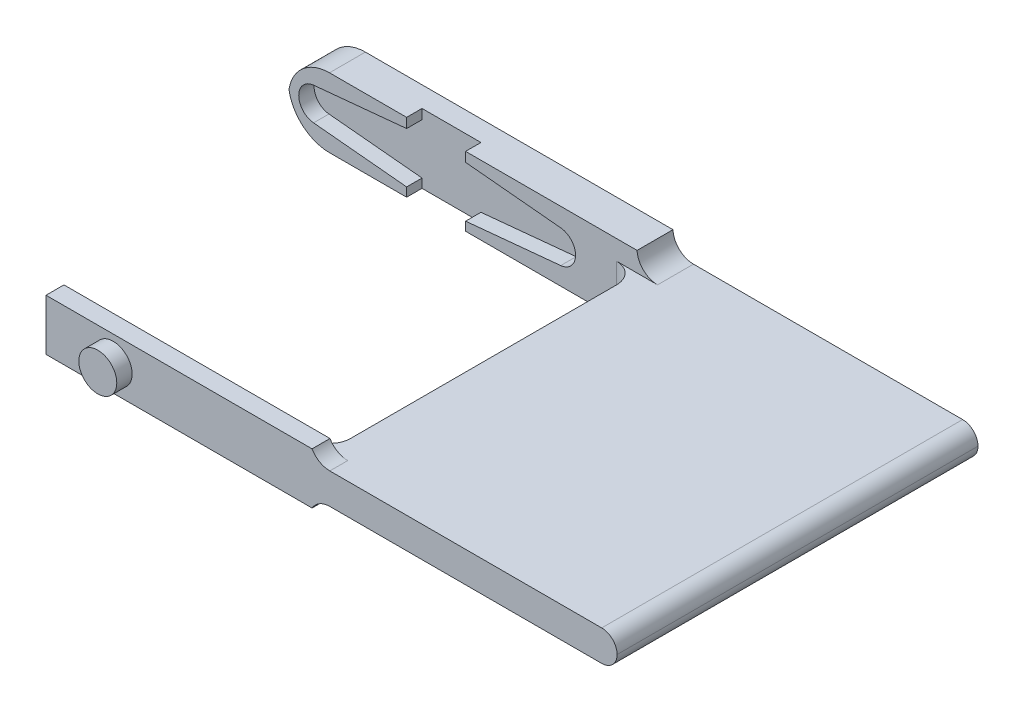
ISO-10303-21;
HEADER;
FILE_DESCRIPTION(('STEP AP214'),'2;1');
FILE_NAME('part.step','',(''),(''),'','','');
FILE_SCHEMA(('AUTOMOTIVE_DESIGN { 1 0 10303 214 1 1 1 1 }'));
ENDSEC;
DATA;
#1=APPLICATION_CONTEXT('core data for automotive mechanical design processes');
#2=APPLICATION_PROTOCOL_DEFINITION('international standard','automotive_design',2000,#1);
#3=PRODUCT_CONTEXT('',#1,'mechanical');
#4=PRODUCT('Part','Part','',(#3));
#5=PRODUCT_RELATED_PRODUCT_CATEGORY('part','',(#4));
#6=PRODUCT_DEFINITION_FORMATION('','',#4);
#7=PRODUCT_DEFINITION_CONTEXT('part definition',#1,'design');
#8=PRODUCT_DEFINITION('design','',#6,#7);
#9=PRODUCT_DEFINITION_SHAPE('','',#8);
#10=(LENGTH_UNIT() NAMED_UNIT(*) SI_UNIT(.MILLI.,.METRE.));
#11=(NAMED_UNIT(*) PLANE_ANGLE_UNIT() SI_UNIT($,.RADIAN.));
#12=(NAMED_UNIT(*) SI_UNIT($,.STERADIAN.) SOLID_ANGLE_UNIT());
#13=UNCERTAINTY_MEASURE_WITH_UNIT(LENGTH_MEASURE(1.E-05),#10,'distance_accuracy_value','');
#14=(GEOMETRIC_REPRESENTATION_CONTEXT(3) GLOBAL_UNCERTAINTY_ASSIGNED_CONTEXT((#13)) GLOBAL_UNIT_ASSIGNED_CONTEXT((#10,
#11,#12)) REPRESENTATION_CONTEXT('',''));
#15=CARTESIAN_POINT('',(0.,0.,0.));
#16=DIRECTION('',(0.,0.,1.));
#17=DIRECTION('',(1.,0.,0.));
#18=AXIS2_PLACEMENT_3D('',#15,#16,#17);
#19=CARTESIAN_POINT('',(0.,0.,35.2));
#20=DIRECTION('',(0.,0.,1.));
#21=DIRECTION('',(1.,0.,0.));
#22=AXIS2_PLACEMENT_3D('',#19,#20,#21);
#23=PLANE('',#22);
#24=CARTESIAN_POINT('',(47.75,3.33707186120483,35.2));
#25=DIRECTION('',(0.,0.,1.));
#26=DIRECTION('',(1.,0.,0.));
#27=AXIS2_PLACEMENT_3D('',#24,#25,#26);
#28=CIRCLE('',#27,1.5);
#29=CARTESIAN_POINT('',(47.75,1.83707186120483,35.2));
#30=VERTEX_POINT('',#29);
#31=CARTESIAN_POINT('',(49.25,3.33707186120483,35.2));
#32=VERTEX_POINT('',#31);
#33=EDGE_CURVE('E156',#30,#32,#28,.T.);
#34=ORIENTED_EDGE('',*,*,#33,.T.);
#35=CARTESIAN_POINT('',(47.75,3.33707186120483,35.2));
#36=DIRECTION('',(0.,0.,1.));
#37=DIRECTION('',(1.,0.,0.));
#38=AXIS2_PLACEMENT_3D('',#35,#36,#37);
#39=CIRCLE('',#38,1.5);
#40=CARTESIAN_POINT('',(47.75,4.83707186120483,35.2));
#41=VERTEX_POINT('',#40);
#42=EDGE_CURVE('E149',#32,#41,#39,.T.);
#43=ORIENTED_EDGE('',*,*,#42,.T.);
#44=DIRECTION('',(1.,0.,0.));
#45=VECTOR('',#44,1.);
#46=CARTESIAN_POINT('',(0.,4.83707186120483,35.2));
#47=LINE('',#46,#45);
#48=CARTESIAN_POINT('',(21.2320508075689,4.83707186120483,35.2));
#49=VERTEX_POINT('',#48);
#50=EDGE_CURVE('E506',#49,#41,#47,.T.);
#51=ORIENTED_EDGE('',*,*,#50,.F.);
#52=CARTESIAN_POINT('',(21.2320508075689,6.83707186120483,35.2));
#53=DIRECTION('',(0.,0.,1.));
#54=DIRECTION('',(1.,0.,0.));
#55=AXIS2_PLACEMENT_3D('',#52,#53,#54);
#56=CIRCLE('',#55,2.);
#57=CARTESIAN_POINT('',(19.5,5.83707186120483,35.2));
#58=VERTEX_POINT('',#57);
#59=EDGE_CURVE('E445',#49,#58,#56,.F.);
#60=ORIENTED_EDGE('',*,*,#59,.T.);
#61=DIRECTION('',(1.,0.,0.));
#62=VECTOR('',#61,1.);
#63=CARTESIAN_POINT('',(0.,5.83707186120483,35.2));
#64=LINE('',#63,#62);
#65=CARTESIAN_POINT('',(-6.45,5.83707186120483,35.2));
#66=VERTEX_POINT('',#65);
#67=EDGE_CURVE('E569',#66,#58,#64,.T.);
#68=ORIENTED_EDGE('',*,*,#67,.F.);
#69=DIRECTION('',(0.,-1.,0.));
#70=VECTOR('',#69,1.);
#71=CARTESIAN_POINT('',(-6.45,0.,35.2));
#72=LINE('',#71,#70);
#73=CARTESIAN_POINT('',(-6.45,0.837071861204826,35.2));
#74=VERTEX_POINT('',#73);
#75=EDGE_CURVE('E493',#66,#74,#72,.T.);
#76=ORIENTED_EDGE('',*,*,#75,.T.);
#77=DIRECTION('',(1.,0.,0.));
#78=VECTOR('',#77,1.);
#79=CARTESIAN_POINT('',(0.,0.837071861204826,35.2));
#80=LINE('',#79,#78);
#81=CARTESIAN_POINT('',(19.5,0.837071861204826,35.2));
#82=VERTEX_POINT('',#81);
#83=EDGE_CURVE('E578',#74,#82,#80,.T.);
#84=ORIENTED_EDGE('',*,*,#83,.T.);
#85=CARTESIAN_POINT('',(21.2320508075689,-0.16292813879517,35.2));
#86=DIRECTION('',(0.,0.,1.));
#87=DIRECTION('',(1.,0.,0.));
#88=AXIS2_PLACEMENT_3D('',#85,#86,#87);
#89=CIRCLE('',#88,2.);
#90=CARTESIAN_POINT('',(21.2320508075689,1.83707186120483,35.2));
#91=VERTEX_POINT('',#90);
#92=EDGE_CURVE('E441',#82,#91,#89,.F.);
#93=ORIENTED_EDGE('',*,*,#92,.T.);
#94=DIRECTION('',(1.,0.,0.));
#95=VECTOR('',#94,1.);
#96=CARTESIAN_POINT('',(0.,1.83707186120483,35.2));
#97=LINE('',#96,#95);
#98=EDGE_CURVE('E585',#91,#30,#97,.T.);
#99=ORIENTED_EDGE('',*,*,#98,.T.);
#100=EDGE_LOOP('',(#34,#43,#51,#60,#68,#76,#84,#93,#99));
#101=FACE_BOUND('',#100,.T.);
#102=CARTESIAN_POINT('',(0.102107464173086,3.37500000000001,35.2));
#103=DIRECTION('',(0.,0.,1.));
#104=DIRECTION('',(1.,0.,0.));
#105=AXIS2_PLACEMENT_3D('',#102,#103,#104);
#106=CIRCLE('',#105,1.85);
#107=CARTESIAN_POINT('',(1.95210746417309,3.37500000000001,35.2));
#108=VERTEX_POINT('',#107);
#109=EDGE_CURVE('E525',#108,#108,#106,.T.);
#110=ORIENTED_EDGE('',*,*,#109,.F.);
#111=EDGE_LOOP('',(#110));
#112=FACE_BOUND('',#111,.T.);
#113=ADVANCED_FACE('F140',(#101,#112),#23,.T.);
#114=CARTESIAN_POINT('',(0.,0.,3.5));
#115=DIRECTION('',(0.,0.,1.));
#116=DIRECTION('',(1.,0.,0.));
#117=AXIS2_PLACEMENT_3D('',#114,#115,#116);
#118=PLANE('',#117);
#119=DIRECTION('',(0.,1.,0.));
#120=VECTOR('',#119,1.);
#121=CARTESIAN_POINT('',(2.77289253582673,0.,3.5));
#122=LINE('',#121,#120);
#123=CARTESIAN_POINT('',(2.77289253582673,0.,3.5));
#124=VERTEX_POINT('',#123);
#125=CARTESIAN_POINT('',(2.77289253582673,0.853325704371567,3.5));
#126=VERTEX_POINT('',#125);
#127=EDGE_CURVE('E361',#124,#126,#122,.T.);
#128=ORIENTED_EDGE('',*,*,#127,.F.);
#129=DIRECTION('',(1.,0.,0.));
#130=VECTOR('',#129,1.);
#131=CARTESIAN_POINT('',(0.,0.,3.5));
#132=LINE('',#131,#130);
#133=CARTESIAN_POINT('',(19.5,0.,3.5));
#134=VERTEX_POINT('',#133);
#135=EDGE_CURVE('E378',#124,#134,#132,.T.);
#136=ORIENTED_EDGE('',*,*,#135,.T.);
#137=CARTESIAN_POINT('',(21.4933525582768,-0.16292813879517,3.5));
#138=DIRECTION('',(0.,0.,1.));
#139=DIRECTION('',(1.,0.,0.));
#140=AXIS2_PLACEMENT_3D('',#137,#138,#139);
#141=CIRCLE('',#140,2.);
#142=CARTESIAN_POINT('',(21.4933525582768,1.83707186120483,3.5));
#143=VERTEX_POINT('',#142);
#144=EDGE_CURVE('E455',#134,#143,#141,.F.);
#145=ORIENTED_EDGE('',*,*,#144,.T.);
#146=DIRECTION('',(1.,0.,0.));
#147=VECTOR('',#146,1.);
#148=CARTESIAN_POINT('',(0.,1.83707186120483,3.5));
#149=LINE('',#148,#147);
#150=CARTESIAN_POINT('',(17.5,1.83707186120483,3.5));
#151=VERTEX_POINT('',#150);
#152=EDGE_CURVE('E418',#151,#143,#149,.T.);
#153=ORIENTED_EDGE('',*,*,#152,.F.);
#154=DIRECTION('',(0.,1.,0.));
#155=VECTOR('',#154,1.);
#156=CARTESIAN_POINT('',(17.5,4.83707186120483,3.5));
#157=LINE('',#156,#155);
#158=CARTESIAN_POINT('',(17.5,4.83707186120483,3.5));
#159=VERTEX_POINT('',#158);
#160=EDGE_CURVE('E457',#151,#159,#157,.T.);
#161=ORIENTED_EDGE('',*,*,#160,.T.);
#162=DIRECTION('',(-1.,0.,0.));
#163=VECTOR('',#162,1.);
#164=CARTESIAN_POINT('',(0.,4.83707186120483,3.5));
#165=LINE('',#164,#163);
#166=CARTESIAN_POINT('',(21.4981037237807,4.83707186120483,3.5));
#167=VERTEX_POINT('',#166);
#168=EDGE_CURVE('E429',#167,#159,#165,.T.);
#169=ORIENTED_EDGE('',*,*,#168,.F.);
#170=CARTESIAN_POINT('',(21.4981037237807,6.83707186120483,3.5));
#171=DIRECTION('',(0.,0.,1.));
#172=DIRECTION('',(1.,0.,0.));
#173=AXIS2_PLACEMENT_3D('',#170,#171,#172);
#174=CIRCLE('',#173,2.);
#175=CARTESIAN_POINT('',(19.5,6.75,3.5));
#176=VERTEX_POINT('',#175);
#177=EDGE_CURVE('E449',#167,#176,#174,.F.);
#178=ORIENTED_EDGE('',*,*,#177,.T.);
#179=DIRECTION('',(1.,0.,0.));
#180=VECTOR('',#179,1.);
#181=CARTESIAN_POINT('',(0.,6.75,3.5));
#182=LINE('',#181,#180);
#183=CARTESIAN_POINT('',(2.77289253582673,6.7500000000001,3.5));
#184=VERTEX_POINT('',#183);
#185=EDGE_CURVE('E406',#184,#176,#182,.T.);
#186=ORIENTED_EDGE('',*,*,#185,.F.);
#187=DIRECTION('',(0.,1.,0.));
#188=VECTOR('',#187,1.);
#189=CARTESIAN_POINT('',(2.77289253582673,6.7500000000001,3.5));
#190=LINE('',#189,#188);
#191=CARTESIAN_POINT('',(2.77289253582673,5.82081801803809,3.5));
#192=VERTEX_POINT('',#191);
#193=EDGE_CURVE('E554',#192,#184,#190,.T.);
#194=ORIENTED_EDGE('',*,*,#193,.F.);
#195=DIRECTION('',(-0.995421689915833,0.0955806426276088,0.));
#196=VECTOR('',#195,1.);
#197=CARTESIAN_POINT('',(0.579142550837787,6.03146244688038,3.5));
#198=LINE('',#197,#196);
#199=CARTESIAN_POINT('',(12.0529290282042,4.92974656507016,3.5));
#200=VERTEX_POINT('',#199);
#201=EDGE_CURVE('E377',#200,#192,#198,.T.);
#202=ORIENTED_EDGE('',*,*,#201,.F.);
#203=CARTESIAN_POINT('',(11.9,3.33707186120483,3.5));
#204=DIRECTION('',(0.,0.,1.));
#205=DIRECTION('',(1.,0.,0.));
#206=AXIS2_PLACEMENT_3D('',#203,#204,#205);
#207=CIRCLE('',#206,1.59999999999999);
#208=CARTESIAN_POINT('',(12.0529290282042,1.7443971573395,3.5));
#209=VERTEX_POINT('',#208);
#210=EDGE_CURVE('E381',#200,#209,#207,.F.);
#211=ORIENTED_EDGE('',*,*,#210,.T.);
#212=DIRECTION('',(-0.995421689915833,-0.0955806426276091,0.));
#213=VECTOR('',#212,1.);
#214=CARTESIAN_POINT('',(-0.0558558043959016,0.581708572728471,3.5));
#215=LINE('',#214,#213);
#216=EDGE_CURVE('E389',#209,#126,#215,.T.);
#217=ORIENTED_EDGE('',*,*,#216,.T.);
#218=EDGE_LOOP('',(#128,#136,#145,#153,#161,#169,#178,#186,#194,#202,#211,#217));
#219=FACE_BOUND('',#218,.T.);
#220=ADVANCED_FACE('F652',(#219),#118,.T.);
#221=CARTESIAN_POINT('',(19.5,0.,65.1008779135329));
#222=DIRECTION('',(-1.,0.,0.));
#223=DIRECTION('',(0.,0.,1.));
#224=AXIS2_PLACEMENT_3D('',#221,#222,#223);
#225=PLANE('',#224);
#226=DIRECTION('',(0.,0.,-1.));
#227=VECTOR('',#226,1.);
#228=CARTESIAN_POINT('',(19.5,4.83707186120483,65.1008779135329));
#229=LINE('',#228,#227);
#230=CARTESIAN_POINT('',(19.5,4.83707186120483,31.45));
#231=VERTEX_POINT('',#230);
#232=CARTESIAN_POINT('',(19.5,4.83707186120483,5.5));
#233=VERTEX_POINT('',#232);
#234=EDGE_CURVE('E594',#231,#233,#229,.T.);
#235=ORIENTED_EDGE('',*,*,#234,.T.);
#236=DIRECTION('',(0.,1.,0.));
#237=VECTOR('',#236,1.);
#238=CARTESIAN_POINT('',(19.5,1.83707186120483,5.5));
#239=LINE('',#238,#237);
#240=CARTESIAN_POINT('',(19.5,1.83707186120483,5.5));
#241=VERTEX_POINT('',#240);
#242=EDGE_CURVE('E462',#233,#241,#239,.F.);
#243=ORIENTED_EDGE('',*,*,#242,.T.);
#244=DIRECTION('',(0.,0.,-1.));
#245=VECTOR('',#244,1.);
#246=CARTESIAN_POINT('',(19.5,1.83707186120483,65.1008779135329));
#247=LINE('',#246,#245);
#248=CARTESIAN_POINT('',(19.5,1.83707186120483,31.45));
#249=VERTEX_POINT('',#248);
#250=EDGE_CURVE('E516',#249,#241,#247,.T.);
#251=ORIENTED_EDGE('',*,*,#250,.F.);
#252=DIRECTION('',(0.,-1.,0.));
#253=VECTOR('',#252,1.);
#254=CARTESIAN_POINT('',(19.5,0.,31.45));
#255=LINE('',#254,#253);
#256=EDGE_CURVE('E460',#249,#231,#255,.F.);
#257=ORIENTED_EDGE('',*,*,#256,.T.);
#258=EDGE_LOOP('',(#235,#243,#251,#257));
#259=FACE_BOUND('',#258,.T.);
#260=ADVANCED_FACE('F671',(#259),#225,.T.);
#261=CARTESIAN_POINT('',(0.579142550837787,6.03146244688038,3.5));
#262=DIRECTION('',(-0.0955806426276088,-0.995421689915833,0.));
#263=DIRECTION('',(0.995421689915833,-0.0955806426276088,0.));
#264=AXIS2_PLACEMENT_3D('',#261,#262,#263);
#265=PLANE('',#264);
#266=DIRECTION('',(0.,0.,1.));
#267=VECTOR('',#266,1.);
#268=CARTESIAN_POINT('',(2.77289253582673,5.82081801803809,3.5));
#269=LINE('',#268,#267);
#270=CARTESIAN_POINT('',(2.77289253582673,5.82081801803809,2.));
#271=VERTEX_POINT('',#270);
#272=EDGE_CURVE('E494',#271,#192,#269,.T.);
#273=ORIENTED_EDGE('',*,*,#272,.F.);
#274=DIRECTION('',(-0.995421689915833,0.0955806426276088,0.));
#275=VECTOR('',#274,1.);
#276=CARTESIAN_POINT('',(0.579142550837787,6.03146244688038,2.));
#277=LINE('',#276,#275);
#278=CARTESIAN_POINT('',(12.0529290282042,4.92974656507016,2.));
#279=VERTEX_POINT('',#278);
#280=EDGE_CURVE('E605',#279,#271,#277,.T.);
#281=ORIENTED_EDGE('',*,*,#280,.F.);
#282=DIRECTION('',(0.,0.,-1.));
#283=VECTOR('',#282,1.);
#284=CARTESIAN_POINT('',(12.0529290282042,4.92974656507016,3.5));
#285=LINE('',#284,#283);
#286=EDGE_CURVE('E415',#200,#279,#285,.T.);
#287=ORIENTED_EDGE('',*,*,#286,.F.);
#288=ORIENTED_EDGE('',*,*,#201,.T.);
#289=EDGE_LOOP('',(#273,#281,#287,#288));
#290=FACE_BOUND('',#289,.T.);
#291=ADVANCED_FACE('F734',(#290),#265,.T.);
#292=CARTESIAN_POINT('',(11.9,3.33707186120483,3.5));
#293=DIRECTION('',(0.,0.,-1.));
#294=DIRECTION('',(-1.,0.,0.));
#295=AXIS2_PLACEMENT_3D('',#292,#293,#294);
#296=CYLINDRICAL_SURFACE('',#295,1.59999999999999);
#297=ORIENTED_EDGE('',*,*,#286,.T.);
#298=CARTESIAN_POINT('',(11.9,3.33707186120483,2.));
#299=DIRECTION('',(0.,0.,1.));
#300=DIRECTION('',(1.,0.,0.));
#301=AXIS2_PLACEMENT_3D('',#298,#299,#300);
#302=CIRCLE('',#301,1.59999999999999);
#303=CARTESIAN_POINT('',(12.0529290282042,1.7443971573395,2.));
#304=VERTEX_POINT('',#303);
#305=EDGE_CURVE('E404',#279,#304,#302,.F.);
#306=ORIENTED_EDGE('',*,*,#305,.T.);
#307=DIRECTION('',(0.,0.,-1.));
#308=VECTOR('',#307,1.);
#309=CARTESIAN_POINT('',(12.0529290282042,1.7443971573395,3.5));
#310=LINE('',#309,#308);
#311=EDGE_CURVE('E412',#209,#304,#310,.T.);
#312=ORIENTED_EDGE('',*,*,#311,.F.);
#313=ORIENTED_EDGE('',*,*,#210,.F.);
#314=EDGE_LOOP('',(#297,#306,#312,#313));
#315=FACE_BOUND('',#314,.T.);
#316=ADVANCED_FACE('F730',(#315),#296,.F.);
#317=CARTESIAN_POINT('',(-0.0558558043959016,0.581708572728471,3.5));
#318=DIRECTION('',(0.0955806426276091,-0.995421689915833,0.));
#319=DIRECTION('',(0.995421689915833,0.0955806426276091,0.));
#320=AXIS2_PLACEMENT_3D('',#317,#318,#319);
#321=PLANE('',#320);
#322=DIRECTION('',(-0.995421689915833,-0.0955806426276091,0.));
#323=VECTOR('',#322,1.);
#324=CARTESIAN_POINT('',(-0.0558558043959016,0.581708572728471,2.));
#325=LINE('',#324,#323);
#326=CARTESIAN_POINT('',(2.77289253582673,0.853325704371567,2.));
#327=VERTEX_POINT('',#326);
#328=EDGE_CURVE('E608',#304,#327,#325,.T.);
#329=ORIENTED_EDGE('',*,*,#328,.T.);
#330=DIRECTION('',(0.,0.,1.));
#331=VECTOR('',#330,1.);
#332=CARTESIAN_POINT('',(2.77289253582673,0.853325704371567,3.5));
#333=LINE('',#332,#331);
#334=EDGE_CURVE('E542',#327,#126,#333,.T.);
#335=ORIENTED_EDGE('',*,*,#334,.T.);
#336=ORIENTED_EDGE('',*,*,#216,.F.);
#337=ORIENTED_EDGE('',*,*,#311,.T.);
#338=EDGE_LOOP('',(#329,#335,#336,#337));
#339=FACE_BOUND('',#338,.T.);
#340=ADVANCED_FACE('F727',(#339),#321,.F.);
#341=CARTESIAN_POINT('',(0.0558558043959013,0.581708572728472,3.5));
#342=DIRECTION('',(0.0955806426276086,0.995421689915833,0.));
#343=DIRECTION('',(-0.995421689915833,0.0955806426276086,0.));
#344=AXIS2_PLACEMENT_3D('',#341,#342,#343);
#345=PLANE('',#344);
#346=DIRECTION('',(0.,0.,1.));
#347=VECTOR('',#346,1.);
#348=CARTESIAN_POINT('',(-2.97710746417325,0.872934473482435,3.5));
#349=LINE('',#348,#347);
#350=CARTESIAN_POINT('',(-2.97710746417325,0.872934473482435,2.));
#351=VERTEX_POINT('',#350);
#352=CARTESIAN_POINT('',(-2.97710746417325,0.872934473482435,3.5));
#353=VERTEX_POINT('',#352);
#354=EDGE_CURVE('E356',#351,#353,#349,.T.);
#355=ORIENTED_EDGE('',*,*,#354,.F.);
#356=DIRECTION('',(0.995421689915833,-0.0955806426276086,0.));
#357=VECTOR('',#356,1.);
#358=CARTESIAN_POINT('',(0.0558558043959013,0.581708572728472,2.));
#359=LINE('',#358,#357);
#360=CARTESIAN_POINT('',(-12.0529290282042,1.7443971573395,2.));
#361=VERTEX_POINT('',#360);
#362=EDGE_CURVE('E612',#361,#351,#359,.T.);
#363=ORIENTED_EDGE('',*,*,#362,.F.);
#364=DIRECTION('',(0.,0.,-1.));
#365=VECTOR('',#364,1.);
#366=CARTESIAN_POINT('',(-12.0529290282042,1.7443971573395,3.5));
#367=LINE('',#366,#365);
#368=CARTESIAN_POINT('',(-12.0529290282042,1.7443971573395,3.5));
#369=VERTEX_POINT('',#368);
#370=EDGE_CURVE('E409',#369,#361,#367,.T.);
#371=ORIENTED_EDGE('',*,*,#370,.F.);
#372=DIRECTION('',(0.995421689915833,-0.0955806426276086,0.));
#373=VECTOR('',#372,1.);
#374=CARTESIAN_POINT('',(0.0558558043959013,0.581708572728472,3.5));
#375=LINE('',#374,#373);
#376=EDGE_CURVE('E392',#369,#353,#375,.T.);
#377=ORIENTED_EDGE('',*,*,#376,.T.);
#378=EDGE_LOOP('',(#355,#363,#371,#377));
#379=FACE_BOUND('',#378,.T.);
#380=ADVANCED_FACE('F626',(#379),#345,.T.);
#381=CARTESIAN_POINT('',(-11.9,3.33707186120483,3.5));
#382=DIRECTION('',(0.,0.,-1.));
#383=DIRECTION('',(-1.,0.,0.));
#384=AXIS2_PLACEMENT_3D('',#381,#382,#383);
#385=CYLINDRICAL_SURFACE('',#384,1.6);
#386=CARTESIAN_POINT('',(-11.9,3.33707186120483,2.));
#387=DIRECTION('',(0.,0.,1.));
#388=DIRECTION('',(1.,0.,0.));
#389=AXIS2_PLACEMENT_3D('',#386,#387,#388);
#390=CIRCLE('',#389,1.6);
#391=CARTESIAN_POINT('',(-12.0529290282042,4.92974656507016,2.));
#392=VERTEX_POINT('',#391);
#393=EDGE_CURVE('E617',#392,#361,#390,.T.);
#394=ORIENTED_EDGE('',*,*,#393,.F.);
#395=DIRECTION('',(0.,0.,-1.));
#396=VECTOR('',#395,1.);
#397=CARTESIAN_POINT('',(-12.0529290282042,4.92974656507016,3.5));
#398=LINE('',#397,#396);
#399=CARTESIAN_POINT('',(-12.0529290282042,4.92974656507016,3.5));
#400=VERTEX_POINT('',#399);
#401=EDGE_CURVE('E400',#400,#392,#398,.T.);
#402=ORIENTED_EDGE('',*,*,#401,.F.);
#403=CARTESIAN_POINT('',(-11.9,3.33707186120483,3.5));
#404=DIRECTION('',(0.,0.,1.));
#405=DIRECTION('',(1.,0.,0.));
#406=AXIS2_PLACEMENT_3D('',#403,#404,#405);
#407=CIRCLE('',#406,1.6);
#408=EDGE_CURVE('E394',#400,#369,#407,.T.);
#409=ORIENTED_EDGE('',*,*,#408,.T.);
#410=ORIENTED_EDGE('',*,*,#370,.T.);
#411=EDGE_LOOP('',(#394,#402,#409,#410));
#412=FACE_BOUND('',#411,.T.);
#413=ADVANCED_FACE('F628',(#412),#385,.F.);
#414=CARTESIAN_POINT('',(0.,6.75,3.5));
#415=DIRECTION('',(0.,1.,0.));
#416=DIRECTION('',(0.,0.,1.));
#417=AXIS2_PLACEMENT_3D('',#414,#415,#416);
#418=PLANE('',#417);
#419=DIRECTION('',(0.,0.,1.));
#420=VECTOR('',#419,1.);
#421=CARTESIAN_POINT('',(2.77289253582673,6.7500000000001,-3.85902082262897));
#422=LINE('',#421,#420);
#423=CARTESIAN_POINT('',(2.77289253582673,6.7500000000001,2.));
#424=VERTEX_POINT('',#423);
#425=EDGE_CURVE('E549',#424,#184,#422,.T.);
#426=ORIENTED_EDGE('',*,*,#425,.T.);
#427=ORIENTED_EDGE('',*,*,#185,.T.);
#428=DIRECTION('',(0.,0.,-1.));
#429=VECTOR('',#428,1.);
#430=CARTESIAN_POINT('',(19.5,6.75,11.9001488082057));
#431=LINE('',#430,#429);
#432=CARTESIAN_POINT('',(19.5,6.75,0.));
#433=VERTEX_POINT('',#432);
#434=EDGE_CURVE('E601',#176,#433,#431,.T.);
#435=ORIENTED_EDGE('',*,*,#434,.T.);
#436=DIRECTION('',(1.,0.,0.));
#437=VECTOR('',#436,1.);
#438=CARTESIAN_POINT('',(0.,6.75,0.));
#439=LINE('',#438,#437);
#440=CARTESIAN_POINT('',(-10.5,6.75,0.));
#441=VERTEX_POINT('',#440);
#442=EDGE_CURVE('E401',#441,#433,#439,.T.);
#443=ORIENTED_EDGE('',*,*,#442,.F.);
#444=DIRECTION('',(0.,0.,-1.));
#445=VECTOR('',#444,1.);
#446=CARTESIAN_POINT('',(-10.5,6.75,3.5));
#447=LINE('',#446,#445);
#448=CARTESIAN_POINT('',(-10.5,6.75,3.5));
#449=VERTEX_POINT('',#448);
#450=EDGE_CURVE('E481',#441,#449,#447,.F.);
#451=ORIENTED_EDGE('',*,*,#450,.T.);
#452=CARTESIAN_POINT('',(-2.97710746417325,6.75,3.5));
#453=VERTEX_POINT('',#452);
#454=EDGE_CURVE('E383',#449,#453,#182,.T.);
#455=ORIENTED_EDGE('',*,*,#454,.T.);
#456=DIRECTION('',(0.,0.,1.));
#457=VECTOR('',#456,1.);
#458=CARTESIAN_POINT('',(-2.97710746417325,6.7500000000001,-3.85902082262897));
#459=LINE('',#458,#457);
#460=CARTESIAN_POINT('',(-2.97710746417325,6.7500000000001,2.));
#461=VERTEX_POINT('',#460);
#462=EDGE_CURVE('E556',#461,#453,#459,.T.);
#463=ORIENTED_EDGE('',*,*,#462,.F.);
#464=DIRECTION('',(1.,0.,0.));
#465=VECTOR('',#464,1.);
#466=CARTESIAN_POINT('',(-2.97710746417325,6.7500000000001,2.));
#467=LINE('',#466,#465);
#468=EDGE_CURVE('E548',#461,#424,#467,.T.);
#469=ORIENTED_EDGE('',*,*,#468,.T.);
#470=EDGE_LOOP('',(#426,#427,#435,#443,#451,#455,#463,#469));
#471=FACE_BOUND('',#470,.T.);
#472=ADVANCED_FACE('F643',(#471),#418,.T.);
#473=CARTESIAN_POINT('',(0.,0.,3.5));
#474=DIRECTION('',(0.,1.,0.));
#475=DIRECTION('',(0.,0.,1.));
#476=AXIS2_PLACEMENT_3D('',#473,#474,#475);
#477=PLANE('',#476);
#478=ORIENTED_EDGE('',*,*,#135,.F.);
#479=DIRECTION('',(0.,0.,1.));
#480=VECTOR('',#479,1.);
#481=CARTESIAN_POINT('',(2.77289253582673,0.,-3.85902082262897));
#482=LINE('',#481,#480);
#483=CARTESIAN_POINT('',(2.77289253582673,0.,2.));
#484=VERTEX_POINT('',#483);
#485=EDGE_CURVE('E372',#484,#124,#482,.T.);
#486=ORIENTED_EDGE('',*,*,#485,.F.);
#487=DIRECTION('',(-1.,0.,0.));
#488=VECTOR('',#487,1.);
#489=CARTESIAN_POINT('',(-2.97710746417325,0.,2.));
#490=LINE('',#489,#488);
#491=CARTESIAN_POINT('',(-2.97710746417325,0.,2.));
#492=VERTEX_POINT('',#491);
#493=EDGE_CURVE('E371',#484,#492,#490,.T.);
#494=ORIENTED_EDGE('',*,*,#493,.T.);
#495=DIRECTION('',(0.,0.,1.));
#496=VECTOR('',#495,1.);
#497=CARTESIAN_POINT('',(-2.97710746417325,0.,-3.85902082262897));
#498=LINE('',#497,#496);
#499=CARTESIAN_POINT('',(-2.97710746417325,0.,3.5));
#500=VERTEX_POINT('',#499);
#501=EDGE_CURVE('E353',#492,#500,#498,.T.);
#502=ORIENTED_EDGE('',*,*,#501,.T.);
#503=CARTESIAN_POINT('',(-10.5,0.,3.5));
#504=VERTEX_POINT('',#503);
#505=EDGE_CURVE('E367',#504,#500,#132,.T.);
#506=ORIENTED_EDGE('',*,*,#505,.F.);
#507=DIRECTION('',(0.,0.,-1.));
#508=VECTOR('',#507,1.);
#509=CARTESIAN_POINT('',(-10.5,0.,0.));
#510=LINE('',#509,#508);
#511=CARTESIAN_POINT('',(-10.5,0.,0.));
#512=VERTEX_POINT('',#511);
#513=EDGE_CURVE('E487',#504,#512,#510,.T.);
#514=ORIENTED_EDGE('',*,*,#513,.T.);
#515=DIRECTION('',(1.,0.,0.));
#516=VECTOR('',#515,1.);
#517=CARTESIAN_POINT('',(0.,0.,0.));
#518=LINE('',#517,#516);
#519=CARTESIAN_POINT('',(19.5,0.,0.));
#520=VERTEX_POINT('',#519);
#521=EDGE_CURVE('E403',#512,#520,#518,.T.);
#522=ORIENTED_EDGE('',*,*,#521,.T.);
#523=DIRECTION('',(0.,0.,-1.));
#524=VECTOR('',#523,1.);
#525=CARTESIAN_POINT('',(19.5,0.,11.9001488082057));
#526=LINE('',#525,#524);
#527=EDGE_CURVE('E602',#134,#520,#526,.T.);
#528=ORIENTED_EDGE('',*,*,#527,.F.);
#529=EDGE_LOOP('',(#478,#486,#494,#502,#506,#514,#522,#528));
#530=FACE_BOUND('',#529,.T.);
#531=ADVANCED_FACE('F366',(#530),#477,.F.);
#532=CARTESIAN_POINT('',(-0.579142550837787,6.03146244688038,3.5));
#533=DIRECTION('',(-0.0955806426276088,0.995421689915833,0.));
#534=DIRECTION('',(-0.995421689915833,-0.0955806426276088,0.));
#535=AXIS2_PLACEMENT_3D('',#532,#533,#534);
#536=PLANE('',#535);
#537=DIRECTION('',(0.995421689915833,0.0955806426276088,0.));
#538=VECTOR('',#537,1.);
#539=CARTESIAN_POINT('',(-0.579142550837787,6.03146244688038,2.));
#540=LINE('',#539,#538);
#541=CARTESIAN_POINT('',(-2.97710746417325,5.80120924892722,2.));
#542=VERTEX_POINT('',#541);
#543=EDGE_CURVE('E611',#392,#542,#540,.T.);
#544=ORIENTED_EDGE('',*,*,#543,.T.);
#545=DIRECTION('',(0.,0.,1.));
#546=VECTOR('',#545,1.);
#547=CARTESIAN_POINT('',(-2.97710746417325,5.80120924892722,3.5));
#548=LINE('',#547,#546);
#549=CARTESIAN_POINT('',(-2.97710746417325,5.80120924892722,3.5));
#550=VERTEX_POINT('',#549);
#551=EDGE_CURVE('E561',#542,#550,#548,.T.);
#552=ORIENTED_EDGE('',*,*,#551,.T.);
#553=DIRECTION('',(0.995421689915833,0.0955806426276088,0.));
#554=VECTOR('',#553,1.);
#555=CARTESIAN_POINT('',(-0.579142550837787,6.03146244688038,3.5));
#556=LINE('',#555,#554);
#557=EDGE_CURVE('E397',#400,#550,#556,.T.);
#558=ORIENTED_EDGE('',*,*,#557,.F.);
#559=ORIENTED_EDGE('',*,*,#401,.T.);
#560=EDGE_LOOP('',(#544,#552,#558,#559));
#561=FACE_BOUND('',#560,.T.);
#562=ADVANCED_FACE('F635',(#561),#536,.F.);
#563=DIRECTION('',(0.,-1.,0.));
#564=VECTOR('',#563,1.);
#565=CARTESIAN_POINT('',(-2.97710746417325,0.,3.5));
#566=LINE('',#565,#564);
#567=EDGE_CURVE('E350',#353,#500,#566,.T.);
#568=ORIENTED_EDGE('',*,*,#567,.F.);
#569=ORIENTED_EDGE('',*,*,#376,.F.);
#570=ORIENTED_EDGE('',*,*,#408,.F.);
#571=ORIENTED_EDGE('',*,*,#557,.T.);
#572=DIRECTION('',(0.,-1.,0.));
#573=VECTOR('',#572,1.);
#574=CARTESIAN_POINT('',(-2.97710746417325,6.7500000000001,3.5));
#575=LINE('',#574,#573);
#576=EDGE_CURVE('E545',#453,#550,#575,.T.);
#577=ORIENTED_EDGE('',*,*,#576,.F.);
#578=ORIENTED_EDGE('',*,*,#454,.F.);
#579=CARTESIAN_POINT('',(-10.5,2.75,3.5));
#580=DIRECTION('',(0.,0.,1.));
#581=DIRECTION('',(1.,0.,0.));
#582=AXIS2_PLACEMENT_3D('',#579,#580,#581);
#583=CIRCLE('',#582,4.);
#584=CARTESIAN_POINT('',(-14.4508701573198,3.37499999999999,3.5));
#585=VERTEX_POINT('',#584);
#586=EDGE_CURVE('E485',#449,#585,#583,.T.);
#587=ORIENTED_EDGE('',*,*,#586,.T.);
#588=CARTESIAN_POINT('',(-10.5,4.,3.5));
#589=DIRECTION('',(0.,0.,1.));
#590=DIRECTION('',(1.,0.,0.));
#591=AXIS2_PLACEMENT_3D('',#588,#589,#590);
#592=CIRCLE('',#591,4.);
#593=EDGE_CURVE('E376',#585,#504,#592,.T.);
#594=ORIENTED_EDGE('',*,*,#593,.T.);
#595=ORIENTED_EDGE('',*,*,#505,.T.);
#596=EDGE_LOOP('',(#568,#569,#570,#571,#577,#578,#587,#594,#595));
#597=FACE_BOUND('',#596,.T.);
#598=ADVANCED_FACE('F374',(#597),#118,.T.);
#599=CARTESIAN_POINT('',(0.,0.,0.));
#600=DIRECTION('',(0.,0.,1.));
#601=DIRECTION('',(1.,0.,0.));
#602=AXIS2_PLACEMENT_3D('',#599,#600,#601);
#603=PLANE('',#602);
#604=DIRECTION('',(1.,0.,0.));
#605=VECTOR('',#604,1.);
#606=CARTESIAN_POINT('',(0.,4.83707186120483,0.));
#607=LINE('',#606,#605);
#608=CARTESIAN_POINT('',(21.4981037237807,4.83707186120483,0.));
#609=VERTEX_POINT('',#608);
#610=CARTESIAN_POINT('',(47.75,4.83707186120483,0.));
#611=VERTEX_POINT('',#610);
#612=EDGE_CURVE('E517',#609,#611,#607,.T.);
#613=ORIENTED_EDGE('',*,*,#612,.T.);
#614=CARTESIAN_POINT('',(47.75,3.33707186120483,0.));
#615=DIRECTION('',(0.,0.,1.));
#616=DIRECTION('',(1.,0.,0.));
#617=AXIS2_PLACEMENT_3D('',#614,#615,#616);
#618=CIRCLE('',#617,1.5);
#619=CARTESIAN_POINT('',(49.25,3.33707186120483,0.));
#620=VERTEX_POINT('',#619);
#621=EDGE_CURVE('E499',#611,#620,#618,.F.);
#622=ORIENTED_EDGE('',*,*,#621,.T.);
#623=CARTESIAN_POINT('',(47.75,3.33707186120483,0.));
#624=DIRECTION('',(0.,0.,1.));
#625=DIRECTION('',(1.,0.,0.));
#626=AXIS2_PLACEMENT_3D('',#623,#624,#625);
#627=CIRCLE('',#626,1.5);
#628=CARTESIAN_POINT('',(47.75,1.83707186120483,0.));
#629=VERTEX_POINT('',#628);
#630=EDGE_CURVE('E497',#620,#629,#627,.F.);
#631=ORIENTED_EDGE('',*,*,#630,.T.);
#632=DIRECTION('',(1.,0.,0.));
#633=VECTOR('',#632,1.);
#634=CARTESIAN_POINT('',(0.,1.83707186120483,0.));
#635=LINE('',#634,#633);
#636=CARTESIAN_POINT('',(21.4933525582768,1.83707186120483,0.));
#637=VERTEX_POINT('',#636);
#638=EDGE_CURVE('E593',#637,#629,#635,.T.);
#639=ORIENTED_EDGE('',*,*,#638,.F.);
#640=CARTESIAN_POINT('',(21.4933525582768,-0.16292813879517,0.));
#641=DIRECTION('',(0.,0.,1.));
#642=DIRECTION('',(1.,0.,0.));
#643=AXIS2_PLACEMENT_3D('',#640,#641,#642);
#644=CIRCLE('',#643,2.);
#645=EDGE_CURVE('E452',#637,#520,#644,.T.);
#646=ORIENTED_EDGE('',*,*,#645,.T.);
#647=ORIENTED_EDGE('',*,*,#521,.F.);
#648=CARTESIAN_POINT('',(-10.5,4.,0.));
#649=DIRECTION('',(0.,0.,1.));
#650=DIRECTION('',(1.,0.,0.));
#651=AXIS2_PLACEMENT_3D('',#648,#649,#650);
#652=CIRCLE('',#651,4.);
#653=CARTESIAN_POINT('',(-14.4508701573198,3.37499999999999,0.));
#654=VERTEX_POINT('',#653);
#655=EDGE_CURVE('E477',#512,#654,#652,.F.);
#656=ORIENTED_EDGE('',*,*,#655,.T.);
#657=CARTESIAN_POINT('',(-10.5,2.75,0.));
#658=DIRECTION('',(0.,0.,1.));
#659=DIRECTION('',(1.,0.,0.));
#660=AXIS2_PLACEMENT_3D('',#657,#658,#659);
#661=CIRCLE('',#660,4.);
#662=EDGE_CURVE('E479',#654,#441,#661,.F.);
#663=ORIENTED_EDGE('',*,*,#662,.T.);
#664=ORIENTED_EDGE('',*,*,#442,.T.);
#665=CARTESIAN_POINT('',(21.4981037237807,6.83707186120483,0.));
#666=DIRECTION('',(0.,0.,1.));
#667=DIRECTION('',(1.,0.,0.));
#668=AXIS2_PLACEMENT_3D('',#665,#666,#667);
#669=CIRCLE('',#668,2.);
#670=EDGE_CURVE('E447',#433,#609,#669,.T.);
#671=ORIENTED_EDGE('',*,*,#670,.T.);
#672=EDGE_LOOP('',(#613,#622,#631,#639,#646,#647,#656,#663,#664,#671));
#673=FACE_BOUND('',#672,.T.);
#674=ADVANCED_FACE('F522',(#673),#603,.F.);
#675=CARTESIAN_POINT('',(0.,0.,2.));
#676=DIRECTION('',(0.,0.,1.));
#677=DIRECTION('',(1.,0.,0.));
#678=AXIS2_PLACEMENT_3D('',#675,#676,#677);
#679=PLANE('',#678);
#680=ORIENTED_EDGE('',*,*,#362,.T.);
#681=DIRECTION('',(0.,1.,0.));
#682=VECTOR('',#681,1.);
#683=CARTESIAN_POINT('',(-2.97710746417325,0.,2.));
#684=LINE('',#683,#682);
#685=EDGE_CURVE('E534',#492,#351,#684,.T.);
#686=ORIENTED_EDGE('',*,*,#685,.F.);
#687=ORIENTED_EDGE('',*,*,#493,.F.);
#688=DIRECTION('',(0.,-1.,0.));
#689=VECTOR('',#688,1.);
#690=CARTESIAN_POINT('',(2.77289253582673,0.,2.));
#691=LINE('',#690,#689);
#692=EDGE_CURVE('E537',#327,#484,#691,.T.);
#693=ORIENTED_EDGE('',*,*,#692,.F.);
#694=ORIENTED_EDGE('',*,*,#328,.F.);
#695=ORIENTED_EDGE('',*,*,#305,.F.);
#696=ORIENTED_EDGE('',*,*,#280,.T.);
#697=DIRECTION('',(0.,-1.,0.));
#698=VECTOR('',#697,1.);
#699=CARTESIAN_POINT('',(2.77289253582673,6.7500000000001,2.));
#700=LINE('',#699,#698);
#701=EDGE_CURVE('E546',#424,#271,#700,.T.);
#702=ORIENTED_EDGE('',*,*,#701,.F.);
#703=ORIENTED_EDGE('',*,*,#468,.F.);
#704=DIRECTION('',(0.,1.,0.));
#705=VECTOR('',#704,1.);
#706=CARTESIAN_POINT('',(-2.97710746417325,6.7500000000001,2.));
#707=LINE('',#706,#705);
#708=EDGE_CURVE('E552',#542,#461,#707,.T.);
#709=ORIENTED_EDGE('',*,*,#708,.F.);
#710=ORIENTED_EDGE('',*,*,#543,.F.);
#711=ORIENTED_EDGE('',*,*,#393,.T.);
#712=EDGE_LOOP('',(#680,#686,#687,#693,#694,#695,#696,#702,#703,#709,#710,#711));
#713=FACE_BOUND('',#712,.T.);
#714=ADVANCED_FACE('F623',(#713),#679,.T.);
#715=CARTESIAN_POINT('',(0.,4.83707186120483,65.1008779135329));
#716=DIRECTION('',(0.,1.,0.));
#717=DIRECTION('',(0.,0.,1.));
#718=AXIS2_PLACEMENT_3D('',#715,#716,#717);
#719=PLANE('',#718);
#720=ORIENTED_EDGE('',*,*,#50,.T.);
#721=DIRECTION('',(0.,0.,-1.));
#722=VECTOR('',#721,1.);
#723=CARTESIAN_POINT('',(47.75,4.83707186120483,65.1008779135329));
#724=LINE('',#723,#722);
#725=EDGE_CURVE('E489',#41,#611,#724,.T.);
#726=ORIENTED_EDGE('',*,*,#725,.T.);
#727=ORIENTED_EDGE('',*,*,#612,.F.);
#728=DIRECTION('',(0.,0.,1.));
#729=VECTOR('',#728,1.);
#730=CARTESIAN_POINT('',(21.4981037237807,4.83707186120483,3.5));
#731=LINE('',#730,#729);
#732=EDGE_CURVE('E431',#609,#167,#731,.T.);
#733=ORIENTED_EDGE('',*,*,#732,.T.);
#734=ORIENTED_EDGE('',*,*,#168,.T.);
#735=CARTESIAN_POINT('',(17.5,4.83707186120483,5.5));
#736=DIRECTION('',(0.,1.,0.));
#737=DIRECTION('',(0.,0.,1.));
#738=AXIS2_PLACEMENT_3D('',#735,#736,#737);
#739=CIRCLE('',#738,2.);
#740=EDGE_CURVE('E467',#159,#233,#739,.F.);
#741=ORIENTED_EDGE('',*,*,#740,.T.);
#742=ORIENTED_EDGE('',*,*,#234,.F.);
#743=CARTESIAN_POINT('',(17.5,4.83707186120483,31.45));
#744=DIRECTION('',(0.,1.,0.));
#745=DIRECTION('',(0.,0.,1.));
#746=AXIS2_PLACEMENT_3D('',#743,#744,#745);
#747=CIRCLE('',#746,2.);
#748=CARTESIAN_POINT('',(17.5,4.83707186120483,33.45));
#749=VERTEX_POINT('',#748);
#750=EDGE_CURVE('E474',#231,#749,#747,.F.);
#751=ORIENTED_EDGE('',*,*,#750,.T.);
#752=DIRECTION('',(1.,0.,0.));
#753=VECTOR('',#752,1.);
#754=CARTESIAN_POINT('',(0.,4.83707186120483,33.45));
#755=LINE('',#754,#753);
#756=CARTESIAN_POINT('',(21.2320508075689,4.83707186120483,33.45));
#757=VERTEX_POINT('',#756);
#758=EDGE_CURVE('E436',#749,#757,#755,.T.);
#759=ORIENTED_EDGE('',*,*,#758,.T.);
#760=DIRECTION('',(0.,0.,-1.));
#761=VECTOR('',#760,1.);
#762=CARTESIAN_POINT('',(21.2320508075689,4.83707186120483,35.2));
#763=LINE('',#762,#761);
#764=EDGE_CURVE('E434',#757,#49,#763,.F.);
#765=ORIENTED_EDGE('',*,*,#764,.T.);
#766=EDGE_LOOP('',(#720,#726,#727,#733,#734,#741,#742,#751,#759,#765));
#767=FACE_BOUND('',#766,.T.);
#768=ADVANCED_FACE('F512',(#767),#719,.T.);
#769=CARTESIAN_POINT('',(0.,1.83707186120483,65.1008779135329));
#770=DIRECTION('',(0.,1.,0.));
#771=DIRECTION('',(0.,0.,1.));
#772=AXIS2_PLACEMENT_3D('',#769,#770,#771);
#773=PLANE('',#772);
#774=ORIENTED_EDGE('',*,*,#638,.T.);
#775=DIRECTION('',(0.,0.,-1.));
#776=VECTOR('',#775,1.);
#777=CARTESIAN_POINT('',(47.75,1.83707186120483,35.2));
#778=LINE('',#777,#776);
#779=EDGE_CURVE('E13',#629,#30,#778,.F.);
#780=ORIENTED_EDGE('',*,*,#779,.T.);
#781=ORIENTED_EDGE('',*,*,#98,.F.);
#782=DIRECTION('',(0.,0.,1.));
#783=VECTOR('',#782,1.);
#784=CARTESIAN_POINT('',(21.2320508075689,1.83707186120483,65.1008779135329));
#785=LINE('',#784,#783);
#786=CARTESIAN_POINT('',(21.2320508075689,1.83707186120483,33.45));
#787=VERTEX_POINT('',#786);
#788=EDGE_CURVE('E426',#91,#787,#785,.F.);
#789=ORIENTED_EDGE('',*,*,#788,.T.);
#790=DIRECTION('',(-1.,0.,0.));
#791=VECTOR('',#790,1.);
#792=CARTESIAN_POINT('',(0.,1.83707186120483,33.45));
#793=LINE('',#792,#791);
#794=CARTESIAN_POINT('',(17.5,1.83707186120483,33.45));
#795=VERTEX_POINT('',#794);
#796=EDGE_CURVE('E424',#787,#795,#793,.T.);
#797=ORIENTED_EDGE('',*,*,#796,.T.);
#798=CARTESIAN_POINT('',(17.5,1.83707186120483,31.45));
#799=DIRECTION('',(0.,1.,0.));
#800=DIRECTION('',(0.,0.,1.));
#801=AXIS2_PLACEMENT_3D('',#798,#799,#800);
#802=CIRCLE('',#801,2.);
#803=EDGE_CURVE('E472',#795,#249,#802,.T.);
#804=ORIENTED_EDGE('',*,*,#803,.T.);
#805=ORIENTED_EDGE('',*,*,#250,.T.);
#806=CARTESIAN_POINT('',(17.5,1.83707186120483,5.5));
#807=DIRECTION('',(0.,1.,0.));
#808=DIRECTION('',(0.,0.,1.));
#809=AXIS2_PLACEMENT_3D('',#806,#807,#808);
#810=CIRCLE('',#809,2.);
#811=EDGE_CURVE('E469',#241,#151,#810,.T.);
#812=ORIENTED_EDGE('',*,*,#811,.T.);
#813=ORIENTED_EDGE('',*,*,#152,.T.);
#814=DIRECTION('',(0.,0.,-1.));
#815=VECTOR('',#814,1.);
#816=CARTESIAN_POINT('',(21.4933525582768,1.83707186120483,65.1008779135329));
#817=LINE('',#816,#815);
#818=EDGE_CURVE('E421',#143,#637,#817,.T.);
#819=ORIENTED_EDGE('',*,*,#818,.T.);
#820=EDGE_LOOP('',(#774,#780,#781,#789,#797,#804,#805,#812,#813,#819));
#821=FACE_BOUND('',#820,.T.);
#822=ADVANCED_FACE('F666',(#821),#773,.F.);
#823=CARTESIAN_POINT('',(-6.45,0.,33.45));
#824=DIRECTION('',(-1.,0.,0.));
#825=DIRECTION('',(0.,-1.,0.));
#826=AXIS2_PLACEMENT_3D('',#823,#824,#825);
#827=PLANE('',#826);
#828=ORIENTED_EDGE('',*,*,#75,.F.);
#829=DIRECTION('',(0.,0.,1.));
#830=VECTOR('',#829,1.);
#831=CARTESIAN_POINT('',(-6.45,5.83707186120483,33.45));
#832=LINE('',#831,#830);
#833=CARTESIAN_POINT('',(-6.45,5.83707186120483,33.45));
#834=VERTEX_POINT('',#833);
#835=EDGE_CURVE('E583',#834,#66,#832,.T.);
#836=ORIENTED_EDGE('',*,*,#835,.F.);
#837=DIRECTION('',(0.,-1.,0.));
#838=VECTOR('',#837,1.);
#839=CARTESIAN_POINT('',(-6.45,0.,33.45));
#840=LINE('',#839,#838);
#841=CARTESIAN_POINT('',(-6.45,0.837071861204826,33.45));
#842=VERTEX_POINT('',#841);
#843=EDGE_CURVE('E565',#834,#842,#840,.T.);
#844=ORIENTED_EDGE('',*,*,#843,.T.);
#845=DIRECTION('',(0.,0.,1.));
#846=VECTOR('',#845,1.);
#847=CARTESIAN_POINT('',(-6.45,0.837071861204826,33.45));
#848=LINE('',#847,#846);
#849=EDGE_CURVE('E575',#842,#74,#848,.T.);
#850=ORIENTED_EDGE('',*,*,#849,.T.);
#851=EDGE_LOOP('',(#828,#836,#844,#850));
#852=FACE_BOUND('',#851,.T.);
#853=ADVANCED_FACE('F687',(#852),#827,.T.);
#854=CARTESIAN_POINT('',(0.,0.837071861204826,33.45));
#855=DIRECTION('',(0.,-1.,0.));
#856=DIRECTION('',(0.,0.,-1.));
#857=AXIS2_PLACEMENT_3D('',#854,#855,#856);
#858=PLANE('',#857);
#859=ORIENTED_EDGE('',*,*,#83,.F.);
#860=ORIENTED_EDGE('',*,*,#849,.F.);
#861=DIRECTION('',(1.,0.,0.));
#862=VECTOR('',#861,1.);
#863=CARTESIAN_POINT('',(0.,0.837071861204826,33.45));
#864=LINE('',#863,#862);
#865=CARTESIAN_POINT('',(19.5,0.837071861204826,33.45));
#866=VERTEX_POINT('',#865);
#867=EDGE_CURVE('E568',#842,#866,#864,.T.);
#868=ORIENTED_EDGE('',*,*,#867,.T.);
#869=DIRECTION('',(0.,0.,1.));
#870=VECTOR('',#869,1.);
#871=CARTESIAN_POINT('',(19.5,0.837071861204826,33.45));
#872=LINE('',#871,#870);
#873=EDGE_CURVE('E589',#866,#82,#872,.T.);
#874=ORIENTED_EDGE('',*,*,#873,.T.);
#875=EDGE_LOOP('',(#859,#860,#868,#874));
#876=FACE_BOUND('',#875,.T.);
#877=ADVANCED_FACE('F698',(#876),#858,.T.);
#878=CARTESIAN_POINT('',(0.,5.83707186120483,33.45));
#879=DIRECTION('',(0.,-1.,0.));
#880=DIRECTION('',(1.,0.,0.));
#881=AXIS2_PLACEMENT_3D('',#878,#879,#880);
#882=PLANE('',#881);
#883=ORIENTED_EDGE('',*,*,#67,.T.);
#884=DIRECTION('',(0.,0.,1.));
#885=VECTOR('',#884,1.);
#886=CARTESIAN_POINT('',(19.5,5.83707186120483,33.45));
#887=LINE('',#886,#885);
#888=CARTESIAN_POINT('',(19.5,5.83707186120483,33.45));
#889=VERTEX_POINT('',#888);
#890=EDGE_CURVE('E586',#889,#58,#887,.T.);
#891=ORIENTED_EDGE('',*,*,#890,.F.);
#892=DIRECTION('',(1.,0.,0.));
#893=VECTOR('',#892,1.);
#894=CARTESIAN_POINT('',(0.,5.83707186120483,33.45));
#895=LINE('',#894,#893);
#896=EDGE_CURVE('E572',#834,#889,#895,.T.);
#897=ORIENTED_EDGE('',*,*,#896,.F.);
#898=ORIENTED_EDGE('',*,*,#835,.T.);
#899=EDGE_LOOP('',(#883,#891,#897,#898));
#900=FACE_BOUND('',#899,.T.);
#901=ADVANCED_FACE('F683',(#900),#882,.F.);
#902=CARTESIAN_POINT('',(0.,0.,33.45));
#903=DIRECTION('',(0.,0.,1.));
#904=DIRECTION('',(1.,0.,0.));
#905=AXIS2_PLACEMENT_3D('',#902,#903,#904);
#906=PLANE('',#905);
#907=DIRECTION('',(0.,-1.,0.));
#908=VECTOR('',#907,1.);
#909=CARTESIAN_POINT('',(17.5,0.,33.45));
#910=LINE('',#909,#908);
#911=EDGE_CURVE('E464',#749,#795,#910,.T.);
#912=ORIENTED_EDGE('',*,*,#911,.T.);
#913=ORIENTED_EDGE('',*,*,#796,.F.);
#914=CARTESIAN_POINT('',(21.2320508075689,-0.16292813879517,33.45));
#915=DIRECTION('',(0.,0.,1.));
#916=DIRECTION('',(1.,0.,0.));
#917=AXIS2_PLACEMENT_3D('',#914,#915,#916);
#918=CIRCLE('',#917,2.);
#919=EDGE_CURVE('E439',#787,#866,#918,.T.);
#920=ORIENTED_EDGE('',*,*,#919,.T.);
#921=ORIENTED_EDGE('',*,*,#867,.F.);
#922=ORIENTED_EDGE('',*,*,#843,.F.);
#923=ORIENTED_EDGE('',*,*,#896,.T.);
#924=CARTESIAN_POINT('',(21.2320508075689,6.83707186120483,33.45));
#925=DIRECTION('',(0.,0.,1.));
#926=DIRECTION('',(1.,0.,0.));
#927=AXIS2_PLACEMENT_3D('',#924,#925,#926);
#928=CIRCLE('',#927,2.);
#929=EDGE_CURVE('E443',#889,#757,#928,.T.);
#930=ORIENTED_EDGE('',*,*,#929,.T.);
#931=ORIENTED_EDGE('',*,*,#758,.F.);
#932=EDGE_LOOP('',(#912,#913,#920,#921,#922,#923,#930,#931));
#933=FACE_BOUND('',#932,.T.);
#934=ADVANCED_FACE('F696',(#933),#906,.F.);
#935=CARTESIAN_POINT('',(21.2320508075689,-0.16292813879517,33.45));
#936=DIRECTION('',(0.,0.,1.));
#937=DIRECTION('',(1.,0.,0.));
#938=AXIS2_PLACEMENT_3D('',#935,#936,#937);
#939=CYLINDRICAL_SURFACE('',#938,2.);
#940=ORIENTED_EDGE('',*,*,#92,.F.);
#941=ORIENTED_EDGE('',*,*,#873,.F.);
#942=ORIENTED_EDGE('',*,*,#919,.F.);
#943=ORIENTED_EDGE('',*,*,#788,.F.);
#944=EDGE_LOOP('',(#940,#941,#942,#943));
#945=FACE_BOUND('',#944,.T.);
#946=ADVANCED_FACE('F694',(#945),#939,.F.);
#947=CARTESIAN_POINT('',(21.2320508075689,6.83707186120483,33.45));
#948=DIRECTION('',(0.,0.,1.));
#949=DIRECTION('',(1.,0.,0.));
#950=AXIS2_PLACEMENT_3D('',#947,#948,#949);
#951=CYLINDRICAL_SURFACE('',#950,2.);
#952=ORIENTED_EDGE('',*,*,#59,.F.);
#953=ORIENTED_EDGE('',*,*,#764,.F.);
#954=ORIENTED_EDGE('',*,*,#929,.F.);
#955=ORIENTED_EDGE('',*,*,#890,.T.);
#956=EDGE_LOOP('',(#952,#953,#954,#955));
#957=FACE_BOUND('',#956,.T.);
#958=ADVANCED_FACE('F678',(#957),#951,.F.);
#959=CARTESIAN_POINT('',(21.4981037237807,6.83707186120483,11.9001488082057));
#960=DIRECTION('',(0.,0.,-1.));
#961=DIRECTION('',(-1.,0.,0.));
#962=AXIS2_PLACEMENT_3D('',#959,#960,#961);
#963=CYLINDRICAL_SURFACE('',#962,2.);
#964=ORIENTED_EDGE('',*,*,#177,.F.);
#965=ORIENTED_EDGE('',*,*,#732,.F.);
#966=ORIENTED_EDGE('',*,*,#670,.F.);
#967=ORIENTED_EDGE('',*,*,#434,.F.);
#968=EDGE_LOOP('',(#964,#965,#966,#967));
#969=FACE_BOUND('',#968,.T.);
#970=ADVANCED_FACE('F656',(#969),#963,.F.);
#971=CARTESIAN_POINT('',(21.4933525582768,-0.16292813879517,11.9001488082057));
#972=DIRECTION('',(0.,0.,-1.));
#973=DIRECTION('',(-1.,0.,0.));
#974=AXIS2_PLACEMENT_3D('',#971,#972,#973);
#975=CYLINDRICAL_SURFACE('',#974,2.);
#976=ORIENTED_EDGE('',*,*,#144,.F.);
#977=ORIENTED_EDGE('',*,*,#527,.T.);
#978=ORIENTED_EDGE('',*,*,#645,.F.);
#979=ORIENTED_EDGE('',*,*,#818,.F.);
#980=EDGE_LOOP('',(#976,#977,#978,#979));
#981=FACE_BOUND('',#980,.T.);
#982=ADVANCED_FACE('F749',(#981),#975,.F.);
#983=CARTESIAN_POINT('',(17.5,0.,5.5));
#984=DIRECTION('',(0.,-1.,0.));
#985=DIRECTION('',(0.,0.,-1.));
#986=AXIS2_PLACEMENT_3D('',#983,#984,#985);
#987=CYLINDRICAL_SURFACE('',#986,2.);
#988=ORIENTED_EDGE('',*,*,#811,.F.);
#989=ORIENTED_EDGE('',*,*,#242,.F.);
#990=ORIENTED_EDGE('',*,*,#740,.F.);
#991=ORIENTED_EDGE('',*,*,#160,.F.);
#992=EDGE_LOOP('',(#988,#989,#990,#991));
#993=FACE_BOUND('',#992,.T.);
#994=ADVANCED_FACE('F663',(#993),#987,.F.);
#995=CARTESIAN_POINT('',(17.5,0.,31.45));
#996=DIRECTION('',(0.,-1.,0.));
#997=DIRECTION('',(0.,0.,-1.));
#998=AXIS2_PLACEMENT_3D('',#995,#996,#997);
#999=CYLINDRICAL_SURFACE('',#998,2.);
#1000=ORIENTED_EDGE('',*,*,#750,.F.);
#1001=ORIENTED_EDGE('',*,*,#256,.F.);
#1002=ORIENTED_EDGE('',*,*,#803,.F.);
#1003=ORIENTED_EDGE('',*,*,#911,.F.);
#1004=EDGE_LOOP('',(#1000,#1001,#1002,#1003));
#1005=FACE_BOUND('',#1004,.T.);
#1006=ADVANCED_FACE('F674',(#1005),#999,.F.);
#1007=CARTESIAN_POINT('',(-10.5,4.,3.5));
#1008=DIRECTION('',(0.,0.,1.));
#1009=DIRECTION('',(1.,0.,0.));
#1010=AXIS2_PLACEMENT_3D('',#1007,#1008,#1009);
#1011=CYLINDRICAL_SURFACE('',#1010,4.);
#1012=ORIENTED_EDGE('',*,*,#513,.F.);
#1013=ORIENTED_EDGE('',*,*,#593,.F.);
#1014=DIRECTION('',(0.,0.,1.));
#1015=VECTOR('',#1014,1.);
#1016=CARTESIAN_POINT('',(-14.4508701573198,3.37499999999999,1.75));
#1017=LINE('',#1016,#1015);
#1018=EDGE_CURVE('E490',#654,#585,#1017,.T.);
#1019=ORIENTED_EDGE('',*,*,#1018,.F.);
#1020=ORIENTED_EDGE('',*,*,#655,.F.);
#1021=EDGE_LOOP('',(#1012,#1013,#1019,#1020));
#1022=FACE_BOUND('',#1021,.T.);
#1023=ADVANCED_FACE('F757',(#1022),#1011,.T.);
#1024=CARTESIAN_POINT('',(-10.5,2.75,3.5));
#1025=DIRECTION('',(0.,0.,-1.));
#1026=DIRECTION('',(-1.,0.,0.));
#1027=AXIS2_PLACEMENT_3D('',#1024,#1025,#1026);
#1028=CYLINDRICAL_SURFACE('',#1027,4.);
#1029=ORIENTED_EDGE('',*,*,#586,.F.);
#1030=ORIENTED_EDGE('',*,*,#450,.F.);
#1031=ORIENTED_EDGE('',*,*,#662,.F.);
#1032=ORIENTED_EDGE('',*,*,#1018,.T.);
#1033=EDGE_LOOP('',(#1029,#1030,#1031,#1032));
#1034=FACE_BOUND('',#1033,.T.);
#1035=ADVANCED_FACE('F758',(#1034),#1028,.T.);
#1036=CARTESIAN_POINT('',(-2.97710746417325,6.7500000000001,-3.85902082262897));
#1037=DIRECTION('',(-1.,0.,0.));
#1038=DIRECTION('',(0.,-1.,0.));
#1039=AXIS2_PLACEMENT_3D('',#1036,#1037,#1038);
#1040=PLANE('',#1039);
#1041=ORIENTED_EDGE('',*,*,#708,.T.);
#1042=ORIENTED_EDGE('',*,*,#462,.T.);
#1043=ORIENTED_EDGE('',*,*,#576,.T.);
#1044=ORIENTED_EDGE('',*,*,#551,.F.);
#1045=EDGE_LOOP('',(#1041,#1042,#1043,#1044));
#1046=FACE_BOUND('',#1045,.T.);
#1047=ADVANCED_FACE('F638',(#1046),#1040,.F.);
#1048=CARTESIAN_POINT('',(2.77289253582673,6.7500000000001,-3.85902082262897));
#1049=DIRECTION('',(1.,0.,0.));
#1050=DIRECTION('',(0.,1.,0.));
#1051=AXIS2_PLACEMENT_3D('',#1048,#1049,#1050);
#1052=PLANE('',#1051);
#1053=ORIENTED_EDGE('',*,*,#272,.T.);
#1054=ORIENTED_EDGE('',*,*,#193,.T.);
#1055=ORIENTED_EDGE('',*,*,#425,.F.);
#1056=ORIENTED_EDGE('',*,*,#701,.T.);
#1057=EDGE_LOOP('',(#1053,#1054,#1055,#1056));
#1058=FACE_BOUND('',#1057,.T.);
#1059=ADVANCED_FACE('F786',(#1058),#1052,.F.);
#1060=CARTESIAN_POINT('',(2.77289253582673,0.,-3.85902082262897));
#1061=DIRECTION('',(1.,0.,0.));
#1062=DIRECTION('',(0.,0.,-1.));
#1063=AXIS2_PLACEMENT_3D('',#1060,#1061,#1062);
#1064=PLANE('',#1063);
#1065=ORIENTED_EDGE('',*,*,#692,.T.);
#1066=ORIENTED_EDGE('',*,*,#485,.T.);
#1067=ORIENTED_EDGE('',*,*,#127,.T.);
#1068=ORIENTED_EDGE('',*,*,#334,.F.);
#1069=EDGE_LOOP('',(#1065,#1066,#1067,#1068));
#1070=FACE_BOUND('',#1069,.T.);
#1071=ADVANCED_FACE('F783',(#1070),#1064,.F.);
#1072=CARTESIAN_POINT('',(-2.97710746417325,0.,-3.85902082262897));
#1073=DIRECTION('',(-1.,0.,0.));
#1074=DIRECTION('',(0.,0.,1.));
#1075=AXIS2_PLACEMENT_3D('',#1072,#1073,#1074);
#1076=PLANE('',#1075);
#1077=ORIENTED_EDGE('',*,*,#354,.T.);
#1078=ORIENTED_EDGE('',*,*,#567,.T.);
#1079=ORIENTED_EDGE('',*,*,#501,.F.);
#1080=ORIENTED_EDGE('',*,*,#685,.T.);
#1081=EDGE_LOOP('',(#1077,#1078,#1079,#1080));
#1082=FACE_BOUND('',#1081,.T.);
#1083=ADVANCED_FACE('F352',(#1082),#1076,.F.);
#1084=CARTESIAN_POINT('',(0.102107464173086,3.37500000000001,36.7));
#1085=DIRECTION('',(0.,0.,-1.));
#1086=DIRECTION('',(-1.,0.,0.));
#1087=AXIS2_PLACEMENT_3D('',#1084,#1085,#1086);
#1088=CYLINDRICAL_SURFACE('',#1087,1.85);
#1089=CARTESIAN_POINT('',(0.102107464173086,3.37500000000001,36.7));
#1090=DIRECTION('',(0.,0.,1.));
#1091=DIRECTION('',(1.,0.,0.));
#1092=AXIS2_PLACEMENT_3D('',#1089,#1090,#1091);
#1093=CIRCLE('',#1092,1.85);
#1094=CARTESIAN_POINT('',(1.95210746417309,3.37500000000001,36.7));
#1095=VERTEX_POINT('',#1094);
#1096=EDGE_CURVE('E527',#1095,#1095,#1093,.T.);
#1097=ORIENTED_EDGE('',*,*,#1096,.F.);
#1098=EDGE_LOOP('',(#1097));
#1099=FACE_BOUND('',#1098,.T.);
#1100=ORIENTED_EDGE('',*,*,#109,.T.);
#1101=EDGE_LOOP('',(#1100));
#1102=FACE_BOUND('',#1101,.T.);
#1103=ADVANCED_FACE('F772',(#1099,#1102),#1088,.T.);
#1104=CARTESIAN_POINT('',(0.102107464173086,3.37500000000001,36.7));
#1105=DIRECTION('',(0.,0.,1.));
#1106=DIRECTION('',(1.,0.,0.));
#1107=AXIS2_PLACEMENT_3D('',#1104,#1105,#1106);
#1108=PLANE('',#1107);
#1109=ORIENTED_EDGE('',*,*,#1096,.T.);
#1110=EDGE_LOOP('',(#1109));
#1111=FACE_BOUND('',#1110,.T.);
#1112=ADVANCED_FACE('F768',(#1111),#1108,.T.);
#1113=CARTESIAN_POINT('',(47.75,3.33707186120483,65.1008779135329));
#1114=DIRECTION('',(0.,0.,1.));
#1115=DIRECTION('',(1.,0.,0.));
#1116=AXIS2_PLACEMENT_3D('',#1113,#1114,#1115);
#1117=CYLINDRICAL_SURFACE('',#1116,1.5);
#1118=DIRECTION('',(0.,0.,-1.));
#1119=VECTOR('',#1118,1.);
#1120=CARTESIAN_POINT('',(49.25,3.33707186120483,0.));
#1121=LINE('',#1120,#1119);
#1122=EDGE_CURVE('E144',#32,#620,#1121,.T.);
#1123=ORIENTED_EDGE('',*,*,#1122,.F.);
#1124=ORIENTED_EDGE('',*,*,#33,.F.);
#1125=ORIENTED_EDGE('',*,*,#779,.F.);
#1126=ORIENTED_EDGE('',*,*,#630,.F.);
#1127=EDGE_LOOP('',(#1123,#1124,#1125,#1126));
#1128=FACE_BOUND('',#1127,.T.);
#1129=ADVANCED_FACE('F142',(#1128),#1117,.T.);
#1130=CARTESIAN_POINT('',(47.75,3.33707186120483,65.1008779135329));
#1131=DIRECTION('',(0.,0.,-1.));
#1132=DIRECTION('',(-1.,0.,0.));
#1133=AXIS2_PLACEMENT_3D('',#1130,#1131,#1132);
#1134=CYLINDRICAL_SURFACE('',#1133,1.5);
#1135=ORIENTED_EDGE('',*,*,#42,.F.);
#1136=ORIENTED_EDGE('',*,*,#1122,.T.);
#1137=ORIENTED_EDGE('',*,*,#621,.F.);
#1138=ORIENTED_EDGE('',*,*,#725,.F.);
#1139=EDGE_LOOP('',(#1135,#1136,#1137,#1138));
#1140=FACE_BOUND('',#1139,.T.);
#1141=ADVANCED_FACE('F519',(#1140),#1134,.T.);
#1142=CLOSED_SHELL('',(#113,#220,#260,#291,#316,#340,#380,#413,#472,#531,#562,#598,#674,#714,
#768,#822,#853,#877,#901,#934,#946,#958,#970,#982,#994,#1006,#1023,#1035,#1047,#1059,#1071,
#1083,#1103,#1112,#1129,#1141));
#1143=MANIFOLD_SOLID_BREP('B2',#1142);
#1144=ADVANCED_BREP_SHAPE_REPRESENTATION('',(#18,#1143),#14);
#1145=SHAPE_DEFINITION_REPRESENTATION(#9,#1144);
ENDSEC;
END-ISO-10303-21;
